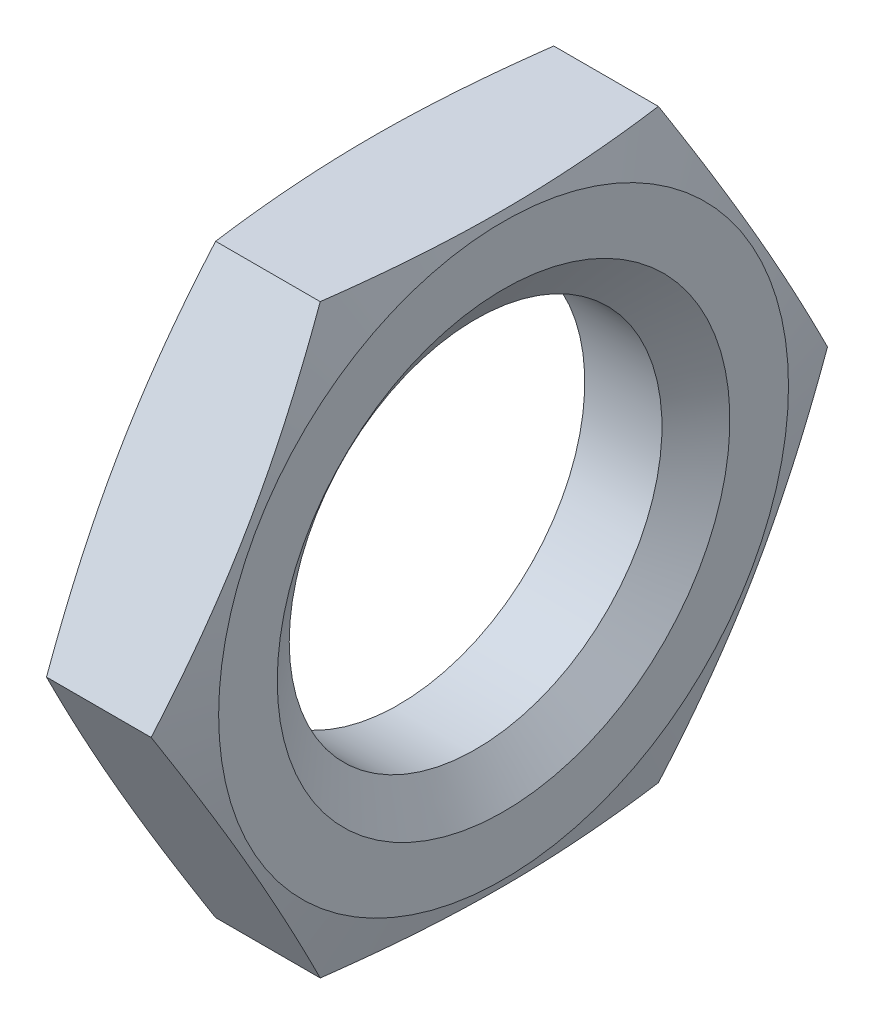
ISO-10303-21;
HEADER;
FILE_DESCRIPTION(('STEP AP214'),'2;1');
FILE_NAME('part.step','',(''),(''),'','','');
FILE_SCHEMA(('AUTOMOTIVE_DESIGN { 1 0 10303 214 1 1 1 1 }'));
ENDSEC;
DATA;
#1=APPLICATION_CONTEXT('core data for automotive mechanical design processes');
#2=APPLICATION_PROTOCOL_DEFINITION('international standard','automotive_design',2000,#1);
#3=PRODUCT_CONTEXT('',#1,'mechanical');
#4=PRODUCT('Part','Part','',(#3));
#5=PRODUCT_RELATED_PRODUCT_CATEGORY('part','',(#4));
#6=PRODUCT_DEFINITION_FORMATION('','',#4);
#7=PRODUCT_DEFINITION_CONTEXT('part definition',#1,'design');
#8=PRODUCT_DEFINITION('design','',#6,#7);
#9=PRODUCT_DEFINITION_SHAPE('','',#8);
#10=(LENGTH_UNIT() NAMED_UNIT(*) SI_UNIT(.MILLI.,.METRE.));
#11=(NAMED_UNIT(*) PLANE_ANGLE_UNIT() SI_UNIT($,.RADIAN.));
#12=(NAMED_UNIT(*) SI_UNIT($,.STERADIAN.) SOLID_ANGLE_UNIT());
#13=UNCERTAINTY_MEASURE_WITH_UNIT(LENGTH_MEASURE(1.E-05),#10,'distance_accuracy_value','');
#14=(GEOMETRIC_REPRESENTATION_CONTEXT(3) GLOBAL_UNCERTAINTY_ASSIGNED_CONTEXT((#13)) GLOBAL_UNIT_ASSIGNED_CONTEXT((#10,
#11,#12)) REPRESENTATION_CONTEXT('',''));
#15=CARTESIAN_POINT('',(0.,0.,0.));
#16=DIRECTION('',(0.,0.,1.));
#17=DIRECTION('',(1.,0.,0.));
#18=AXIS2_PLACEMENT_3D('',#15,#16,#17);
#19=CARTESIAN_POINT('',(2.5,0.,-6.35085296108588));
#20=DIRECTION('',(1.,0.,0.));
#21=DIRECTION('',(0.,0.,-1.));
#22=AXIS2_PLACEMENT_3D('',#19,#20,#21);
#23=PLANE('',#22);
#24=CARTESIAN_POINT('',(2.5,0.,0.));
#25=DIRECTION('',(-1.,0.,0.));
#26=DIRECTION('',(0.,0.,1.));
#27=AXIS2_PLACEMENT_3D('',#24,#25,#26);
#28=CIRCLE('',#27,4.25);
#29=CARTESIAN_POINT('',(2.5,0.,4.25));
#30=VERTEX_POINT('',#29);
#31=EDGE_CURVE('E220',#30,#30,#28,.T.);
#32=ORIENTED_EDGE('',*,*,#31,.T.);
#33=EDGE_LOOP('',(#32));
#34=FACE_BOUND('',#33,.T.);
#35=CARTESIAN_POINT('',(2.5,0.,0.));
#36=DIRECTION('',(-1.,0.,0.));
#37=DIRECTION('',(0.,0.,1.));
#38=AXIS2_PLACEMENT_3D('',#35,#36,#37);
#39=CIRCLE('',#38,5.35085296108588);
#40=CARTESIAN_POINT('',(2.5,0.,5.35085296108588));
#41=VERTEX_POINT('',#40);
#42=EDGE_CURVE('E205',#41,#41,#39,.T.);
#43=ORIENTED_EDGE('',*,*,#42,.F.);
#44=EDGE_LOOP('',(#43));
#45=FACE_BOUND('',#44,.T.);
#46=ADVANCED_FACE('F31',(#34,#45),#23,.T.);
#47=CARTESIAN_POINT('',(2.23205080756889,0.,0.));
#48=DIRECTION('',(-1.,0.,0.));
#49=DIRECTION('',(0.,0.,1.));
#50=AXIS2_PLACEMENT_3D('',#47,#48,#49);
#51=CONICAL_SURFACE('',#50,6.35085296108588,1.30899693899576);
#52=ORIENTED_EDGE('',*,*,#42,.T.);
#53=EDGE_LOOP('',(#52));
#54=FACE_BOUND('',#53,.T.);
#55=CARTESIAN_POINT('',(2.23201986661741,-5.5002,-3.1753110104891));
#56=CARTESIAN_POINT('',(2.26737151162748,-5.27178224927437,-3.30718806035824));
#57=CARTESIAN_POINT('',(2.29946500235455,-5.04295034408125,-3.43930422242066));
#58=CARTESIAN_POINT('',(2.35585029341694,-4.58447837603354,-3.7040031365889));
#59=CARTESIAN_POINT('',(2.38013892468663,-4.35483802308176,-3.83658605618241));
#60=CARTESIAN_POINT('',(2.41949651038344,-3.89614150611578,-4.10141461372906));
#61=CARTESIAN_POINT('',(2.43461240156884,-3.6670884439752,-4.23365846081464));
#62=CARTESIAN_POINT('',(2.45488126821387,-3.20869021114574,-4.49831480393477));
#63=CARTESIAN_POINT('',(2.46003617136947,-2.97934510557287,-4.63072726237459));
#64=CARTESIAN_POINT('',(2.46003617136947,-2.52065489442713,-4.89555217925423));
#65=CARTESIAN_POINT('',(2.45488126821387,-2.29130978885426,-5.02796463769405));
#66=CARTESIAN_POINT('',(2.43461240156884,-1.8329115560248,-5.29262098081419));
#67=CARTESIAN_POINT('',(2.41949651038344,-1.60385849388422,-5.42486482789976));
#68=CARTESIAN_POINT('',(2.38013892468663,-1.14516197691824,-5.68969338544641));
#69=CARTESIAN_POINT('',(2.35585029341694,-0.915521623966466,-5.82227630503992));
#70=CARTESIAN_POINT('',(2.29946500235455,-0.457049655918756,-6.08697521920816));
#71=CARTESIAN_POINT('',(2.26737151162748,-0.228217750725632,-6.21909138127059));
#72=CARTESIAN_POINT('',(2.23201986661741,0.000200000000001465,-6.35096843113972));
#73=B_SPLINE_CURVE_WITH_KNOTS('',3,(#55,#56,#57,#58,#59,#60,#61,#62,#63,#64,#65,#66,#67,#68,#69,
#70,#71,#72),.UNSPECIFIED.,.F.,.F.,(4,2,2,2,2,2,2,2,4),(0.,0.798379902464036,1.59708356868763,
2.3916650401428,3.1860927251517,3.9805204101606,4.77510188161577,5.57380554783936,
6.3721854503034),.UNSPECIFIED.);
#74=CARTESIAN_POINT('',(2.23205080756889,-5.50000000000001,-3.17542648054293));
#75=VERTEX_POINT('',#74);
#76=CARTESIAN_POINT('',(2.23205080756889,0.,-6.35085296108588));
#77=VERTEX_POINT('',#76);
#78=EDGE_CURVE('E194',#75,#77,#73,.T.);
#79=ORIENTED_EDGE('',*,*,#78,.T.);
#80=CARTESIAN_POINT('',(2.23201986661741,-0.000199999999998251,-6.35096843113972));
#81=CARTESIAN_POINT('',(2.26737151162748,0.228217750725634,-6.21909138127059));
#82=CARTESIAN_POINT('',(2.29946500235455,0.457049655918758,-6.08697521920816));
#83=CARTESIAN_POINT('',(2.35585029341694,0.915521623966467,-5.82227630503992));
#84=CARTESIAN_POINT('',(2.38013892468663,1.14516197691825,-5.68969338544641));
#85=CARTESIAN_POINT('',(2.41949651038344,1.60385849388422,-5.42486482789976));
#86=CARTESIAN_POINT('',(2.43461240156884,1.8329115560248,-5.29262098081419));
#87=CARTESIAN_POINT('',(2.45488126821387,2.29130978885426,-5.02796463769405));
#88=CARTESIAN_POINT('',(2.46003617136947,2.52065489442713,-4.89555217925423));
#89=CARTESIAN_POINT('',(2.46003617136947,2.97934510557287,-4.63072726237459));
#90=CARTESIAN_POINT('',(2.45488126821387,3.20869021114574,-4.49831480393477));
#91=CARTESIAN_POINT('',(2.43461240156884,3.6670884439752,-4.23365846081463));
#92=CARTESIAN_POINT('',(2.41949651038344,3.89614150611578,-4.10141461372906));
#93=CARTESIAN_POINT('',(2.38013892468663,4.35483802308176,-3.83658605618241));
#94=CARTESIAN_POINT('',(2.35585029341694,4.58447837603353,-3.7040031365889));
#95=CARTESIAN_POINT('',(2.29946500235455,5.04295034408124,-3.43930422242066));
#96=CARTESIAN_POINT('',(2.26737151162748,5.27178224927437,-3.30718806035823));
#97=CARTESIAN_POINT('',(2.23201986661741,5.5002,-3.1753110104891));
#98=B_SPLINE_CURVE_WITH_KNOTS('',3,(#80,#81,#82,#83,#84,#85,#86,#87,#88,#89,#90,#91,#92,#93,#94,
#95,#96,#97),.UNSPECIFIED.,.F.,.F.,(4,2,2,2,2,2,2,2,4),(0.,0.798379902464034,1.59708356868763,
2.3916650401428,3.18609272515169,3.98052041016059,4.77510188161576,5.57380554783935,
6.37218545030339),.UNSPECIFIED.);
#99=CARTESIAN_POINT('',(2.23205080756889,5.5,-3.17542648054294));
#100=VERTEX_POINT('',#99);
#101=EDGE_CURVE('E121',#77,#100,#98,.T.);
#102=ORIENTED_EDGE('',*,*,#101,.T.);
#103=CARTESIAN_POINT('',(1.24511812311218,5.5,-8.39248967357683));
#104=CARTESIAN_POINT('',(1.30100378769512,5.5,-8.14305660960824));
#105=CARTESIAN_POINT('',(1.35620467718188,5.5,-7.89346731934267));
#106=CARTESIAN_POINT('',(1.46486729065078,5.5,-7.39389957758472));
#107=CARTESIAN_POINT('',(1.51832893928115,5.5,-7.14392110972175));
#108=CARTESIAN_POINT('',(1.6231901902578,5.5,-6.64327335227768));
#109=CARTESIAN_POINT('',(1.67458770894926,5.5,-6.39260362471131));
#110=CARTESIAN_POINT('',(1.77476469288153,5.5,-5.89074186134932));
#111=CARTESIAN_POINT('',(1.82354418030007,5.5,-5.63954982999694));
#112=CARTESIAN_POINT('',(1.91748512016332,5.5,-5.1385602583105));
#113=CARTESIAN_POINT('',(1.9626723208235,5.5,-4.88876756993107));
#114=CARTESIAN_POINT('',(2.04909321378185,5.5,-4.3885004113485));
#115=CARTESIAN_POINT('',(2.09032699327634,5.5,-4.13802595630772));
#116=CARTESIAN_POINT('',(2.16791101436559,5.5,-3.63634751621525));
#117=CARTESIAN_POINT('',(2.20426186971051,5.5,-3.38514362691108));
#118=CARTESIAN_POINT('',(2.27100744642318,5.5,-2.88193672723408));
#119=CARTESIAN_POINT('',(2.30140216253249,5.5,-2.62993371615594));
#120=CARTESIAN_POINT('',(2.35537317089146,5.5,-2.12228838222805));
#121=CARTESIAN_POINT('',(2.37886798178985,5.5,-1.86663726596456));
#122=CARTESIAN_POINT('',(2.41741731524635,5.5,-1.35469399102192));
#123=CARTESIAN_POINT('',(2.43247203136967,5.5,-1.09840184717953));
#124=CARTESIAN_POINT('',(2.45326304243536,5.5,-0.585548156581367));
#125=CARTESIAN_POINT('',(2.45900354631518,5.5,-0.328986783961889));
#126=CARTESIAN_POINT('',(2.4608133821082,5.5,0.184170586346425));
#127=CARTESIAN_POINT('',(2.45688272094889,5.5,0.440766584010328));
#128=CARTESIAN_POINT('',(2.43957125656513,5.5,0.954568261768439));
#129=CARTESIAN_POINT('',(2.42615610392627,5.5,1.21177276091473));
#130=CARTESIAN_POINT('',(2.3906405747507,5.5,1.72557585094103));
#131=CARTESIAN_POINT('',(2.36854000648964,5.5,1.98217442831996));
#132=CARTESIAN_POINT('',(2.31676822959434,5.5,2.49476384827405));
#133=CARTESIAN_POINT('',(2.28709209494727,5.5,2.75075418560622));
#134=CARTESIAN_POINT('',(2.22140121462773,5.5,3.26191119814674));
#135=CARTESIAN_POINT('',(2.18538644930256,5.5,3.51707787079886));
#136=CARTESIAN_POINT('',(2.11073111793396,5.5,4.00971385762619));
#137=CARTESIAN_POINT('',(2.07242330606494,5.5,4.24723410116291));
#138=CARTESIAN_POINT('',(1.99209109357318,5.5,4.72164784868495));
#139=CARTESIAN_POINT('',(1.95006659185651,5.5,4.95854133544189));
#140=CARTESIAN_POINT('',(1.81946866225354,5.5,5.66842768485918));
#141=CARTESIAN_POINT('',(1.7263769592733,5.5,6.14058746083545));
#142=CARTESIAN_POINT('',(1.53215871630118,5.5,7.08334203179498));
#143=CARTESIAN_POINT('',(1.43103024040794,5.5,7.553936421092));
#144=CARTESIAN_POINT('',(1.22328823192818,5.5,8.49387894353116));
#145=CARTESIAN_POINT('',(1.11667501920882,5.5,8.96322714767519));
#146=CARTESIAN_POINT('',(0.900667451567304,5.5,9.89640720615578));
#147=CARTESIAN_POINT('',(0.791310854006441,5.5,10.3602478445023));
#148=CARTESIAN_POINT('',(0.569860038826538,5.5,11.2872825926215));
#149=CARTESIAN_POINT('',(0.457765771476534,5.5,11.7504766904875));
#150=CARTESIAN_POINT('',(0.23169438145977,5.5,12.6758001544558));
#151=CARTESIAN_POINT('',(0.117719745102526,5.5,13.1379301293837));
#152=CARTESIAN_POINT('',(-0.111785576919252,5.5,14.0617876458123));
#153=CARTESIAN_POINT('',(-0.22731621121804,5.5,14.5235152000644));
#154=CARTESIAN_POINT('',(-0.343398122700473,5.5,14.9851024984395));
#155=B_SPLINE_CURVE_WITH_KNOTS('',3,(#103,#104,#105,#106,#107,#108,#109,#110,#111,#112,#113,
#114,#115,#116,#117,#118,#119,#120,#121,#122,#123,#124,#125,#126,#127,#128,#129,#130,#131,#132,
#133,#134,#135,#136,#137,#138,#139,#140,#141,#142,#143,#144,#145,#146,#147,#148,#149,#150,#151,
#152,#153,#154),.UNSPECIFIED.,.F.,.F.,(4,2,2,2,2,2,2,2,2,2,2,2,2,2,2,2,2,2,2,2,2,2,2,2,2,4),(0.,
0.766854190935476,1.53374156133574,2.30138455265248,3.06902104012373,3.83053649357037,
4.59203514722893,5.35343799597632,6.11484151693668,6.88490488652958,7.65495059476033,
8.42464823514552,9.19434532419317,9.9668443538516,10.7393604368316,11.5123801337527,
12.2854022274362,13.0071360083816,13.7288894265218,15.1725145960398,16.6164885668159,
18.0603784209896,19.4900402724415,20.9197281136683,22.3476569023426,23.7755386679991),.UNSPECIFIED.);
#156=CARTESIAN_POINT('',(2.23205080756889,5.5,3.17542648054295));
#157=VERTEX_POINT('',#156);
#158=EDGE_CURVE('E116',#100,#157,#155,.T.);
#159=ORIENTED_EDGE('',*,*,#158,.T.);
#160=CARTESIAN_POINT('',(2.23201986661741,5.5002,3.17531101048911));
#161=CARTESIAN_POINT('',(2.26737151162748,5.27178224927437,3.30718806035824));
#162=CARTESIAN_POINT('',(2.29946500235455,5.04295034408125,3.43930422242066));
#163=CARTESIAN_POINT('',(2.35585029341694,4.58447837603354,3.70400313658891));
#164=CARTESIAN_POINT('',(2.38013892468663,4.35483802308176,3.83658605618242));
#165=CARTESIAN_POINT('',(2.41949651038344,3.89614150611578,4.10141461372906));
#166=CARTESIAN_POINT('',(2.43461240156884,3.6670884439752,4.23365846081464));
#167=CARTESIAN_POINT('',(2.45488126821387,3.20869021114574,4.49831480393477));
#168=CARTESIAN_POINT('',(2.46003617136947,2.97934510557287,4.63072726237459));
#169=CARTESIAN_POINT('',(2.46003617136947,2.52065489442713,4.89555217925423));
#170=CARTESIAN_POINT('',(2.45488126821387,2.29130978885426,5.02796463769405));
#171=CARTESIAN_POINT('',(2.43461240156884,1.8329115560248,5.29262098081419));
#172=CARTESIAN_POINT('',(2.41949651038344,1.60385849388422,5.42486482789976));
#173=CARTESIAN_POINT('',(2.38013892468663,1.14516197691825,5.68969338544641));
#174=CARTESIAN_POINT('',(2.35585029341694,0.915521623966467,5.82227630503992));
#175=CARTESIAN_POINT('',(2.29946500235455,0.457049655918757,6.08697521920816));
#176=CARTESIAN_POINT('',(2.26737151162748,0.228217750725633,6.21909138127059));
#177=CARTESIAN_POINT('',(2.23201986661741,-0.000199999999999302,6.35096843113972));
#178=B_SPLINE_CURVE_WITH_KNOTS('',3,(#160,#161,#162,#163,#164,#165,#166,#167,#168,#169,#170,
#171,#172,#173,#174,#175,#176,#177),.UNSPECIFIED.,.F.,.F.,(4,2,2,2,2,2,2,2,4),(0.,
0.798379902464035,1.59708356868763,2.3916650401428,3.1860927251517,3.9805204101606,
4.77510188161576,5.57380554783936,6.37218545030339),.UNSPECIFIED.);
#179=CARTESIAN_POINT('',(2.23205080756889,0.,6.35085296108588));
#180=VERTEX_POINT('',#179);
#181=EDGE_CURVE('E177',#157,#180,#178,.T.);
#182=ORIENTED_EDGE('',*,*,#181,.T.);
#183=CARTESIAN_POINT('',(2.23201986661741,0.000199999999998312,6.35096843113972));
#184=CARTESIAN_POINT('',(2.26737151162748,-0.228217750725634,6.21909138127059));
#185=CARTESIAN_POINT('',(2.29946500235455,-0.457049655918758,6.08697521920817));
#186=CARTESIAN_POINT('',(2.35585029341694,-0.915521623966468,5.82227630503992));
#187=CARTESIAN_POINT('',(2.38013892468663,-1.14516197691825,5.68969338544641));
#188=CARTESIAN_POINT('',(2.41949651038344,-1.60385849388422,5.42486482789976));
#189=CARTESIAN_POINT('',(2.43461240156884,-1.8329115560248,5.29262098081419));
#190=CARTESIAN_POINT('',(2.45488126821387,-2.29130978885426,5.02796463769405));
#191=CARTESIAN_POINT('',(2.46003617136947,-2.52065489442713,4.89555217925423));
#192=CARTESIAN_POINT('',(2.46003617136947,-2.97934510557287,4.63072726237459));
#193=CARTESIAN_POINT('',(2.45488126821387,-3.20869021114575,4.49831480393477));
#194=CARTESIAN_POINT('',(2.43461240156884,-3.6670884439752,4.23365846081464));
#195=CARTESIAN_POINT('',(2.41949651038344,-3.89614150611579,4.10141461372907));
#196=CARTESIAN_POINT('',(2.38013892468663,-4.35483802308176,3.83658605618242));
#197=CARTESIAN_POINT('',(2.35585029341694,-4.58447837603354,3.70400313658891));
#198=CARTESIAN_POINT('',(2.29946500235455,-5.04295034408125,3.43930422242066));
#199=CARTESIAN_POINT('',(2.26737151162748,-5.27178224927437,3.30718806035824));
#200=CARTESIAN_POINT('',(2.23201986661741,-5.5002,3.17531101048911));
#201=B_SPLINE_CURVE_WITH_KNOTS('',3,(#183,#184,#185,#186,#187,#188,#189,#190,#191,#192,#193,
#194,#195,#196,#197,#198,#199,#200),.UNSPECIFIED.,.F.,.F.,(4,2,2,2,2,2,2,2,4),(0.,
0.798379902464034,1.59708356868763,2.3916650401428,3.1860927251517,3.9805204101606,
4.77510188161576,5.57380554783936,6.37218545030339),.UNSPECIFIED.);
#202=CARTESIAN_POINT('',(2.23205080756889,-5.5,3.17542648054294));
#203=VERTEX_POINT('',#202);
#204=EDGE_CURVE('E47',#180,#203,#201,.T.);
#205=ORIENTED_EDGE('',*,*,#204,.T.);
#206=CARTESIAN_POINT('',(1.24511812311217,-5.50000000000001,-8.39248967357684));
#207=CARTESIAN_POINT('',(1.30100378769512,-5.50000000000001,-8.14305660960825));
#208=CARTESIAN_POINT('',(1.35620467718188,-5.50000000000001,-7.89346731934268));
#209=CARTESIAN_POINT('',(1.46486729065078,-5.50000000000001,-7.39389957758473));
#210=CARTESIAN_POINT('',(1.51832893928115,-5.50000000000001,-7.14392110972175));
#211=CARTESIAN_POINT('',(1.6231901902578,-5.50000000000001,-6.64327335227768));
#212=CARTESIAN_POINT('',(1.67458770894926,-5.50000000000001,-6.39260362471131));
#213=CARTESIAN_POINT('',(1.77476469288153,-5.50000000000001,-5.89074186134932));
#214=CARTESIAN_POINT('',(1.82354418030007,-5.50000000000001,-5.63954982999694));
#215=CARTESIAN_POINT('',(1.91748512016331,-5.50000000000001,-5.1385602583105));
#216=CARTESIAN_POINT('',(1.9626723208235,-5.50000000000001,-4.88876756993108));
#217=CARTESIAN_POINT('',(2.04909321378185,-5.50000000000001,-4.38850041134851));
#218=CARTESIAN_POINT('',(2.09032699327634,-5.50000000000001,-4.13802595630772));
#219=CARTESIAN_POINT('',(2.16791101436559,-5.50000000000001,-3.63634751621525));
#220=CARTESIAN_POINT('',(2.2042618697105,-5.50000000000001,-3.38514362691108));
#221=CARTESIAN_POINT('',(2.27100744642318,-5.50000000000001,-2.88193672723409));
#222=CARTESIAN_POINT('',(2.30140216253248,-5.50000000000001,-2.62993371615594));
#223=CARTESIAN_POINT('',(2.35537317089146,-5.50000000000001,-2.12228838222806));
#224=CARTESIAN_POINT('',(2.37886798178985,-5.50000000000001,-1.86663726596456));
#225=CARTESIAN_POINT('',(2.41741731524635,-5.50000000000001,-1.35469399102192));
#226=CARTESIAN_POINT('',(2.43247203136967,-5.50000000000001,-1.09840184717954));
#227=CARTESIAN_POINT('',(2.45326304243536,-5.50000000000001,-0.585548156581368));
#228=CARTESIAN_POINT('',(2.45900354631518,-5.50000000000001,-0.32898678396189));
#229=CARTESIAN_POINT('',(2.4608133821082,-5.50000000000001,0.184170586346425));
#230=CARTESIAN_POINT('',(2.45688272094889,-5.5,0.440766584010327));
#231=CARTESIAN_POINT('',(2.43957125656513,-5.5,0.954568261768437));
#232=CARTESIAN_POINT('',(2.42615610392627,-5.5,1.21177276091473));
#233=CARTESIAN_POINT('',(2.3906405747507,-5.5,1.72557585094103));
#234=CARTESIAN_POINT('',(2.36854000648964,-5.5,1.98217442831995));
#235=CARTESIAN_POINT('',(2.31676822959434,-5.5,2.49476384827405));
#236=CARTESIAN_POINT('',(2.28709209494727,-5.5,2.75075418560622));
#237=CARTESIAN_POINT('',(2.22140121462773,-5.5,3.26191119814674));
#238=CARTESIAN_POINT('',(2.18538644930256,-5.5,3.51707787079885));
#239=CARTESIAN_POINT('',(2.11073111793396,-5.5,4.00971385762619));
#240=CARTESIAN_POINT('',(2.07242330606494,-5.5,4.24723410116291));
#241=CARTESIAN_POINT('',(1.99209109357318,-5.5,4.72164784868495));
#242=CARTESIAN_POINT('',(1.9500665918565,-5.5,4.95854133544189));
#243=CARTESIAN_POINT('',(1.81946866225353,-5.5,5.66842768485918));
#244=CARTESIAN_POINT('',(1.7263769592733,-5.5,6.14058746083545));
#245=CARTESIAN_POINT('',(1.53215871630118,-5.5,7.08334203179498));
#246=CARTESIAN_POINT('',(1.43103024040794,-5.5,7.553936421092));
#247=CARTESIAN_POINT('',(1.22328823192818,-5.5,8.49387894353116));
#248=CARTESIAN_POINT('',(1.11667501920882,-5.5,8.96322714767519));
#249=CARTESIAN_POINT('',(0.900667451567304,-5.5,9.89640720615578));
#250=CARTESIAN_POINT('',(0.791310854006441,-5.5,10.3602478445023));
#251=CARTESIAN_POINT('',(0.569860038826538,-5.5,11.2872825926215));
#252=CARTESIAN_POINT('',(0.457765771476533,-5.5,11.7504766904875));
#253=CARTESIAN_POINT('',(0.231694381459769,-5.5,12.6758001544558));
#254=CARTESIAN_POINT('',(0.117719745102525,-5.5,13.1379301293837));
#255=CARTESIAN_POINT('',(-0.111785576919252,-5.5,14.0617876458123));
#256=CARTESIAN_POINT('',(-0.227316211218041,-5.5,14.5235152000644));
#257=CARTESIAN_POINT('',(-0.343398122700476,-5.5,14.9851024984395));
#258=B_SPLINE_CURVE_WITH_KNOTS('',3,(#206,#207,#208,#209,#210,#211,#212,#213,#214,#215,#216,
#217,#218,#219,#220,#221,#222,#223,#224,#225,#226,#227,#228,#229,#230,#231,#232,#233,#234,#235,
#236,#237,#238,#239,#240,#241,#242,#243,#244,#245,#246,#247,#248,#249,#250,#251,#252,#253,#254,
#255,#256,#257),.UNSPECIFIED.,.F.,.F.,(4,2,2,2,2,2,2,2,2,2,2,2,2,2,2,2,2,2,2,2,2,2,2,2,2,4),(0.,
0.766854190935477,1.53374156133574,2.30138455265248,3.06902104012374,3.83053649357037,
4.59203514722893,5.35343799597633,6.11484151693668,6.88490488652958,7.65495059476033,
8.42464823514553,9.19434532419318,9.9668443538516,10.7393604368316,11.5123801337528,
12.2854022274362,13.0071360083816,13.7288894265218,15.1725145960398,16.6164885668159,
18.0603784209897,19.4900402724415,20.9197281136683,22.3476569023427,23.7755386679991),.UNSPECIFIED.);
#259=EDGE_CURVE('E125',#203,#75,#258,.F.);
#260=ORIENTED_EDGE('',*,*,#259,.T.);
#261=EDGE_LOOP('',(#79,#102,#159,#182,#205,#260));
#262=FACE_BOUND('',#261,.T.);
#263=ADVANCED_FACE('F148',(#54,#262),#51,.T.);
#264=CARTESIAN_POINT('',(2.5,-5.50000000000001,-3.17542648054294));
#265=DIRECTION('',(0.,0.5,0.866025403784439));
#266=DIRECTION('',(0.,-0.866025403784439,0.5));
#267=AXIS2_PLACEMENT_3D('',#264,#265,#266);
#268=PLANE('',#267);
#269=CARTESIAN_POINT('',(0.267980133382597,0.000200000000001817,-6.35096843113972));
#270=CARTESIAN_POINT('',(0.232628488372524,-0.22821775072563,-6.21909138127059));
#271=CARTESIAN_POINT('',(0.200534997645457,-0.457049655918755,-6.08697521920816));
#272=CARTESIAN_POINT('',(0.144149706583062,-0.915521623966466,-5.82227630503992));
#273=CARTESIAN_POINT('',(0.119861075313372,-1.14516197691825,-5.68969338544641));
#274=CARTESIAN_POINT('',(0.0805034896165583,-1.60385849388422,-5.42486482789976));
#275=CARTESIAN_POINT('',(0.0653875984311642,-1.8329115560248,-5.29262098081419));
#276=CARTESIAN_POINT('',(0.0451187317861272,-2.29130978885426,-5.02796463769405));
#277=CARTESIAN_POINT('',(0.0399638286305299,-2.52065489442713,-4.89555217925423));
#278=CARTESIAN_POINT('',(0.03996382863053,-2.97934510557287,-4.63072726237459));
#279=CARTESIAN_POINT('',(0.0451187317861274,-3.20869021114575,-4.49831480393477));
#280=CARTESIAN_POINT('',(0.0653875984311647,-3.6670884439752,-4.23365846081463));
#281=CARTESIAN_POINT('',(0.0805034896165589,-3.89614150611579,-4.10141461372906));
#282=CARTESIAN_POINT('',(0.119861075313372,-4.35483802308176,-3.83658605618241));
#283=CARTESIAN_POINT('',(0.144149706583063,-4.58447837603354,-3.7040031365889));
#284=CARTESIAN_POINT('',(0.200534997645458,-5.04295034408125,-3.43930422242066));
#285=CARTESIAN_POINT('',(0.232628488372526,-5.27178224927437,-3.30718806035824));
#286=CARTESIAN_POINT('',(0.267980133382599,-5.50020000000001,-3.1753110104891));
#287=B_SPLINE_CURVE_WITH_KNOTS('',3,(#269,#270,#271,#272,#273,#274,#275,#276,#277,#278,#279,
#280,#281,#282,#283,#284,#285,#286),.UNSPECIFIED.,.F.,.F.,(4,2,2,2,2,2,2,2,4),(0.,
0.798379902464036,1.59708356868763,2.3916650401428,3.1860927251517,3.9805204101606,
4.77510188161577,5.57380554783936,6.3721854503034),.UNSPECIFIED.);
#288=CARTESIAN_POINT('',(0.267949192431116,0.,-6.35085296108588));
#289=VERTEX_POINT('',#288);
#290=CARTESIAN_POINT('',(0.267949192431116,-5.50000000000001,-3.17542648054294));
#291=VERTEX_POINT('',#290);
#292=EDGE_CURVE('E55',#289,#291,#287,.T.);
#293=ORIENTED_EDGE('',*,*,#292,.F.);
#294=DIRECTION('',(-1.,0.,0.));
#295=VECTOR('',#294,1.);
#296=CARTESIAN_POINT('',(2.5,0.,-6.35085296108588));
#297=LINE('',#296,#295);
#298=EDGE_CURVE('E11',#77,#289,#297,.T.);
#299=ORIENTED_EDGE('',*,*,#298,.F.);
#300=ORIENTED_EDGE('',*,*,#78,.F.);
#301=DIRECTION('',(-1.,0.,0.));
#302=VECTOR('',#301,1.);
#303=CARTESIAN_POINT('',(2.5,-5.50000000000001,-3.17542648054294));
#304=LINE('',#303,#302);
#305=EDGE_CURVE('E108',#75,#291,#304,.T.);
#306=ORIENTED_EDGE('',*,*,#305,.T.);
#307=EDGE_LOOP('',(#293,#299,#300,#306));
#308=FACE_BOUND('',#307,.T.);
#309=ADVANCED_FACE('F33',(#308),#268,.F.);
#310=CARTESIAN_POINT('',(2.5,0.,-6.35085296108588));
#311=DIRECTION('',(0.,-0.5,0.866025403784438));
#312=DIRECTION('',(0.,-0.866025403784438,-0.5));
#313=AXIS2_PLACEMENT_3D('',#310,#311,#312);
#314=PLANE('',#313);
#315=CARTESIAN_POINT('',(0.267980133382598,5.5002,-3.1753110104891));
#316=CARTESIAN_POINT('',(0.232628488372525,5.27178224927437,-3.30718806035823));
#317=CARTESIAN_POINT('',(0.200534997645457,5.04295034408125,-3.43930422242066));
#318=CARTESIAN_POINT('',(0.144149706583062,4.58447837603354,-3.7040031365889));
#319=CARTESIAN_POINT('',(0.119861075313372,4.35483802308176,-3.83658605618241));
#320=CARTESIAN_POINT('',(0.0805034896165582,3.89614150611578,-4.10141461372906));
#321=CARTESIAN_POINT('',(0.065387598431164,3.6670884439752,-4.23365846081463));
#322=CARTESIAN_POINT('',(0.0451187317861269,3.20869021114574,-4.49831480393477));
#323=CARTESIAN_POINT('',(0.0399638286305296,2.97934510557287,-4.63072726237459));
#324=CARTESIAN_POINT('',(0.0399638286305296,2.52065489442713,-4.89555217925423));
#325=CARTESIAN_POINT('',(0.0451187317861269,2.29130978885426,-5.02796463769405));
#326=CARTESIAN_POINT('',(0.065387598431164,1.8329115560248,-5.29262098081419));
#327=CARTESIAN_POINT('',(0.080503489616558,1.60385849388422,-5.42486482789976));
#328=CARTESIAN_POINT('',(0.119861075313372,1.14516197691825,-5.68969338544641));
#329=CARTESIAN_POINT('',(0.144149706583062,0.915521623966468,-5.82227630503992));
#330=CARTESIAN_POINT('',(0.200534997645457,0.457049655918758,-6.08697521920816));
#331=CARTESIAN_POINT('',(0.232628488372524,0.228217750725634,-6.21909138127059));
#332=CARTESIAN_POINT('',(0.267980133382597,-0.000199999999998516,-6.35096843113972));
#333=B_SPLINE_CURVE_WITH_KNOTS('',3,(#315,#316,#317,#318,#319,#320,#321,#322,#323,#324,#325,
#326,#327,#328,#329,#330,#331,#332),.UNSPECIFIED.,.F.,.F.,(4,2,2,2,2,2,2,2,4),(0.,
0.798379902464035,1.59708356868763,2.3916650401428,3.1860927251517,3.9805204101606,
4.77510188161577,5.57380554783936,6.37218545030339),.UNSPECIFIED.);
#334=CARTESIAN_POINT('',(0.267949192431116,5.5,-3.17542648054294));
#335=VERTEX_POINT('',#334);
#336=EDGE_CURVE('E123',#335,#289,#333,.T.);
#337=ORIENTED_EDGE('',*,*,#336,.F.);
#338=DIRECTION('',(-1.,0.,0.));
#339=VECTOR('',#338,1.);
#340=CARTESIAN_POINT('',(2.5,5.5,-3.17542648054294));
#341=LINE('',#340,#339);
#342=EDGE_CURVE('E40',#100,#335,#341,.T.);
#343=ORIENTED_EDGE('',*,*,#342,.F.);
#344=ORIENTED_EDGE('',*,*,#101,.F.);
#345=ORIENTED_EDGE('',*,*,#298,.T.);
#346=EDGE_LOOP('',(#337,#343,#344,#345));
#347=FACE_BOUND('',#346,.T.);
#348=ADVANCED_FACE('F120',(#347),#314,.F.);
#349=CARTESIAN_POINT('',(2.5,5.5,-3.17542648054294));
#350=DIRECTION('',(0.,-1.,0.));
#351=DIRECTION('',(0.,0.,-1.));
#352=AXIS2_PLACEMENT_3D('',#349,#350,#351);
#353=PLANE('',#352);
#354=CARTESIAN_POINT('',(1.25488187688785,5.5,-8.39248967357684));
#355=CARTESIAN_POINT('',(1.1989962123049,5.5,-8.14305660960825));
#356=CARTESIAN_POINT('',(1.14379532281814,5.5,-7.89346731934268));
#357=CARTESIAN_POINT('',(1.03513270934924,5.5,-7.39389957758472));
#358=CARTESIAN_POINT('',(0.981671060718871,5.5,-7.14392110972175));
#359=CARTESIAN_POINT('',(0.876809809742217,5.5,-6.64327335227768));
#360=CARTESIAN_POINT('',(0.825412291050753,5.5,-6.39260362471131));
#361=CARTESIAN_POINT('',(0.725235307118481,5.5,-5.89074186134932));
#362=CARTESIAN_POINT('',(0.676455819699938,5.5,-5.63954982999694));
#363=CARTESIAN_POINT('',(0.582514879836695,5.5,-5.1385602583105));
#364=CARTESIAN_POINT('',(0.537327679176506,5.5,-4.88876756993107));
#365=CARTESIAN_POINT('',(0.450906786218159,5.5,-4.38850041134851));
#366=CARTESIAN_POINT('',(0.409673006723668,5.5,-4.13802595630772));
#367=CARTESIAN_POINT('',(0.332088985634412,5.5,-3.63634751621525));
#368=CARTESIAN_POINT('',(0.2957381302895,5.5,-3.38514362691108));
#369=CARTESIAN_POINT('',(0.22899255357682,5.5,-2.88193672723409));
#370=CARTESIAN_POINT('',(0.198597837467519,5.5,-2.62993371615594));
#371=CARTESIAN_POINT('',(0.144626829108545,5.5,-2.12228838222806));
#372=CARTESIAN_POINT('',(0.121132018210154,5.5,-1.86663726596456));
#373=CARTESIAN_POINT('',(0.0825826847536466,5.5,-1.35469399102192));
#374=CARTESIAN_POINT('',(0.067527968630327,5.5,-1.09840184717953));
#375=CARTESIAN_POINT('',(0.0467369575646426,5.5,-0.585548156581366));
#376=CARTESIAN_POINT('',(0.0409964536848178,5.5,-0.328986783961888));
#377=CARTESIAN_POINT('',(0.0391866178918017,5.5,0.184170586346428));
#378=CARTESIAN_POINT('',(0.0431172790511136,5.5,0.440766584010331));
#379=CARTESIAN_POINT('',(0.0604287434348688,5.5,0.954568261768443));
#380=CARTESIAN_POINT('',(0.0738438960737274,5.5,1.21177276091474));
#381=CARTESIAN_POINT('',(0.109359425249306,5.5,1.72557585094104));
#382=CARTESIAN_POINT('',(0.131459993510365,5.5,1.98217442831996));
#383=CARTESIAN_POINT('',(0.183231770405668,5.5,2.49476384827406));
#384=CARTESIAN_POINT('',(0.212907905052738,5.5,2.75075418560623));
#385=CARTESIAN_POINT('',(0.278598785372278,5.5,3.26191119814675));
#386=CARTESIAN_POINT('',(0.314613550697448,5.5,3.51707787079886));
#387=CARTESIAN_POINT('',(0.38926888206605,5.5,4.0097138576262));
#388=CARTESIAN_POINT('',(0.427576693935068,5.5,4.24723410116292));
#389=CARTESIAN_POINT('',(0.507908906426827,5.5,4.72164784868496));
#390=CARTESIAN_POINT('',(0.549933408143506,5.5,4.95854133544189));
#391=CARTESIAN_POINT('',(0.680531337746478,5.5,5.66842768485919));
#392=CARTESIAN_POINT('',(0.773623040726712,5.5,6.14058746083546));
#393=CARTESIAN_POINT('',(0.967841283698841,5.5,7.08334203179498));
#394=CARTESIAN_POINT('',(1.06896975959208,5.5,7.553936421092));
#395=CARTESIAN_POINT('',(1.27671176807185,5.5,8.49387894353116));
#396=CARTESIAN_POINT('',(1.3833249807912,5.5,8.96322714767519));
#397=CARTESIAN_POINT('',(1.59933254843272,5.5,9.89640720615578));
#398=CARTESIAN_POINT('',(1.70868914599359,5.5,10.3602478445023));
#399=CARTESIAN_POINT('',(1.9301399611735,5.5,11.2872825926215));
#400=CARTESIAN_POINT('',(2.0422342285235,5.5,11.7504766904875));
#401=CARTESIAN_POINT('',(2.26830561854027,5.5,12.6758001544558));
#402=CARTESIAN_POINT('',(2.38228025489752,5.5,13.1379301293837));
#403=CARTESIAN_POINT('',(2.6117855769193,5.5,14.0617876458123));
#404=CARTESIAN_POINT('',(2.72731621121809,5.5,14.5235152000644));
#405=CARTESIAN_POINT('',(2.84339812270052,5.5,14.9851024984395));
#406=B_SPLINE_CURVE_WITH_KNOTS('',3,(#354,#355,#356,#357,#358,#359,#360,#361,#362,#363,#364,
#365,#366,#367,#368,#369,#370,#371,#372,#373,#374,#375,#376,#377,#378,#379,#380,#381,#382,#383,
#384,#385,#386,#387,#388,#389,#390,#391,#392,#393,#394,#395,#396,#397,#398,#399,#400,#401,#402,
#403,#404,#405),.UNSPECIFIED.,.F.,.F.,(4,2,2,2,2,2,2,2,2,2,2,2,2,2,2,2,2,2,2,2,2,2,2,2,2,4),(0.,
0.766854190935477,1.53374156133574,2.30138455265248,3.06902104012374,3.83053649357037,
4.59203514722893,5.35343799597633,6.11484151693668,6.88490488652958,7.65495059476033,
8.42464823514553,9.19434532419318,9.96684435385161,10.7393604368316,11.5123801337528,
12.2854022274362,13.0071360083816,13.7288894265218,15.1725145960398,16.616488566816,
18.0603784209897,19.4900402724415,20.9197281136683,22.3476569023427,23.7755386679991),.UNSPECIFIED.);
#407=CARTESIAN_POINT('',(0.267949192431116,5.5,3.17542648054294));
#408=VERTEX_POINT('',#407);
#409=EDGE_CURVE('E102',#408,#335,#406,.F.);
#410=ORIENTED_EDGE('',*,*,#409,.F.);
#411=DIRECTION('',(-1.,0.,0.));
#412=VECTOR('',#411,1.);
#413=CARTESIAN_POINT('',(2.5,5.5,3.17542648054294));
#414=LINE('',#413,#412);
#415=EDGE_CURVE('E101',#157,#408,#414,.T.);
#416=ORIENTED_EDGE('',*,*,#415,.F.);
#417=ORIENTED_EDGE('',*,*,#158,.F.);
#418=ORIENTED_EDGE('',*,*,#342,.T.);
#419=EDGE_LOOP('',(#410,#416,#417,#418));
#420=FACE_BOUND('',#419,.T.);
#421=ADVANCED_FACE('F115',(#420),#353,.F.);
#422=CARTESIAN_POINT('',(2.5,5.5,3.17542648054294));
#423=DIRECTION('',(0.,-0.5,-0.866025403784439));
#424=DIRECTION('',(0.,0.866025403784439,-0.5));
#425=AXIS2_PLACEMENT_3D('',#422,#423,#424);
#426=PLANE('',#425);
#427=CARTESIAN_POINT('',(0.267980133382598,-0.000200000000001726,6.35096843113972));
#428=CARTESIAN_POINT('',(0.232628488372525,0.228217750725631,6.21909138127059));
#429=CARTESIAN_POINT('',(0.200534997645458,0.457049655918755,6.08697521920817));
#430=CARTESIAN_POINT('',(0.144149706583063,0.915521623966465,5.82227630503992));
#431=CARTESIAN_POINT('',(0.119861075313372,1.14516197691824,5.68969338544641));
#432=CARTESIAN_POINT('',(0.0805034896165587,1.60385849388422,5.42486482789976));
#433=CARTESIAN_POINT('',(0.0653875984311645,1.8329115560248,5.29262098081419));
#434=CARTESIAN_POINT('',(0.0451187317861275,2.29130978885426,5.02796463769405));
#435=CARTESIAN_POINT('',(0.0399638286305303,2.52065489442713,4.89555217925423));
#436=CARTESIAN_POINT('',(0.0399638286305303,2.97934510557287,4.63072726237459));
#437=CARTESIAN_POINT('',(0.0451187317861277,3.20869021114574,4.49831480393477));
#438=CARTESIAN_POINT('',(0.0653875984311647,3.6670884439752,4.23365846081464));
#439=CARTESIAN_POINT('',(0.0805034896165587,3.89614150611578,4.10141461372907));
#440=CARTESIAN_POINT('',(0.119861075313372,4.35483802308176,3.83658605618242));
#441=CARTESIAN_POINT('',(0.144149706583063,4.58447837603353,3.70400313658891));
#442=CARTESIAN_POINT('',(0.200534997645458,5.04295034408124,3.43930422242066));
#443=CARTESIAN_POINT('',(0.232628488372525,5.27178224927437,3.30718806035824));
#444=CARTESIAN_POINT('',(0.267980133382598,5.5002,3.17531101048911));
#445=B_SPLINE_CURVE_WITH_KNOTS('',3,(#427,#428,#429,#430,#431,#432,#433,#434,#435,#436,#437,
#438,#439,#440,#441,#442,#443,#444),.UNSPECIFIED.,.F.,.F.,(4,2,2,2,2,2,2,2,4),(0.,
0.798379902464034,1.59708356868763,2.3916650401428,3.1860927251517,3.9805204101606,
4.77510188161577,5.57380554783936,6.37218545030339),.UNSPECIFIED.);
#446=CARTESIAN_POINT('',(0.267949192431116,0.,6.35085296108588));
#447=VERTEX_POINT('',#446);
#448=EDGE_CURVE('E86',#447,#408,#445,.T.);
#449=ORIENTED_EDGE('',*,*,#448,.F.);
#450=DIRECTION('',(-1.,0.,0.));
#451=VECTOR('',#450,1.);
#452=CARTESIAN_POINT('',(2.5,0.,6.35085296108589));
#453=LINE('',#452,#451);
#454=EDGE_CURVE('E99',#180,#447,#453,.T.);
#455=ORIENTED_EDGE('',*,*,#454,.F.);
#456=ORIENTED_EDGE('',*,*,#181,.F.);
#457=ORIENTED_EDGE('',*,*,#415,.T.);
#458=EDGE_LOOP('',(#449,#455,#456,#457));
#459=FACE_BOUND('',#458,.T.);
#460=ADVANCED_FACE('F97',(#459),#426,.F.);
#461=CARTESIAN_POINT('',(2.5,0.,6.35085296108589));
#462=DIRECTION('',(0.,0.5,-0.866025403784439));
#463=DIRECTION('',(0.,0.866025403784439,0.5));
#464=AXIS2_PLACEMENT_3D('',#461,#462,#463);
#465=PLANE('',#464);
#466=CARTESIAN_POINT('',(0.267980133382599,-5.5002,3.17531101048911));
#467=CARTESIAN_POINT('',(0.232628488372526,-5.27178224927437,3.30718806035824));
#468=CARTESIAN_POINT('',(0.200534997645459,-5.04295034408125,3.43930422242066));
#469=CARTESIAN_POINT('',(0.144149706583064,-4.58447837603354,3.70400313658891));
#470=CARTESIAN_POINT('',(0.119861075313373,-4.35483802308176,3.83658605618242));
#471=CARTESIAN_POINT('',(0.0805034896165595,-3.89614150611579,4.10141461372907));
#472=CARTESIAN_POINT('',(0.0653875984311654,-3.6670884439752,4.23365846081464));
#473=CARTESIAN_POINT('',(0.0451187317861282,-3.20869021114575,4.49831480393477));
#474=CARTESIAN_POINT('',(0.0399638286305308,-2.97934510557287,4.63072726237459));
#475=CARTESIAN_POINT('',(0.0399638286305307,-2.52065489442713,4.89555217925423));
#476=CARTESIAN_POINT('',(0.045118731786128,-2.29130978885426,5.02796463769405));
#477=CARTESIAN_POINT('',(0.065387598431165,-1.8329115560248,5.29262098081419));
#478=CARTESIAN_POINT('',(0.080503489616559,-1.60385849388422,5.42486482789977));
#479=CARTESIAN_POINT('',(0.119861075313372,-1.14516197691825,5.68969338544641));
#480=CARTESIAN_POINT('',(0.144149706583063,-0.91552162396647,5.82227630503992));
#481=CARTESIAN_POINT('',(0.200534997645458,-0.457049655918759,6.08697521920816));
#482=CARTESIAN_POINT('',(0.232628488372525,-0.228217750725635,6.21909138127059));
#483=CARTESIAN_POINT('',(0.267980133382598,0.000199999999997227,6.35096843113972));
#484=B_SPLINE_CURVE_WITH_KNOTS('',3,(#466,#467,#468,#469,#470,#471,#472,#473,#474,#475,#476,
#477,#478,#479,#480,#481,#482,#483),.UNSPECIFIED.,.F.,.F.,(4,2,2,2,2,2,2,2,4),(0.,
0.798379902464035,1.59708356868763,2.3916650401428,3.1860927251517,3.9805204101606,
4.77510188161576,5.57380554783935,6.37218545030339),.UNSPECIFIED.);
#485=CARTESIAN_POINT('',(0.267949192431116,-5.5,3.17542648054293));
#486=VERTEX_POINT('',#485);
#487=EDGE_CURVE('E83',#486,#447,#484,.T.);
#488=ORIENTED_EDGE('',*,*,#487,.F.);
#489=DIRECTION('',(-1.,0.,0.));
#490=VECTOR('',#489,1.);
#491=CARTESIAN_POINT('',(2.5,-5.5,3.17542648054294));
#492=LINE('',#491,#490);
#493=EDGE_CURVE('E105',#203,#486,#492,.T.);
#494=ORIENTED_EDGE('',*,*,#493,.F.);
#495=ORIENTED_EDGE('',*,*,#204,.F.);
#496=ORIENTED_EDGE('',*,*,#454,.T.);
#497=EDGE_LOOP('',(#488,#494,#495,#496));
#498=FACE_BOUND('',#497,.T.);
#499=ADVANCED_FACE('F104',(#498),#465,.F.);
#500=CARTESIAN_POINT('',(2.5,-5.5,3.17542648054294));
#501=DIRECTION('',(0.,1.,0.));
#502=DIRECTION('',(0.,0.,1.));
#503=AXIS2_PLACEMENT_3D('',#500,#501,#502);
#504=PLANE('',#503);
#505=CARTESIAN_POINT('',(1.25488187688785,-5.50000000000001,-8.39248967357684));
#506=CARTESIAN_POINT('',(1.1989962123049,-5.50000000000001,-8.14305660960825));
#507=CARTESIAN_POINT('',(1.14379532281814,-5.50000000000001,-7.89346731934268));
#508=CARTESIAN_POINT('',(1.03513270934924,-5.50000000000001,-7.39389957758473));
#509=CARTESIAN_POINT('',(0.981671060718872,-5.50000000000001,-7.14392110972175));
#510=CARTESIAN_POINT('',(0.876809809742219,-5.50000000000001,-6.64327335227769));
#511=CARTESIAN_POINT('',(0.825412291050755,-5.50000000000001,-6.39260362471132));
#512=CARTESIAN_POINT('',(0.725235307118483,-5.50000000000001,-5.89074186134932));
#513=CARTESIAN_POINT('',(0.67645581969994,-5.50000000000001,-5.63954982999695));
#514=CARTESIAN_POINT('',(0.582514879836696,-5.50000000000001,-5.1385602583105));
#515=CARTESIAN_POINT('',(0.537327679176507,-5.50000000000001,-4.88876756993108));
#516=CARTESIAN_POINT('',(0.45090678621816,-5.50000000000001,-4.38850041134851));
#517=CARTESIAN_POINT('',(0.409673006723669,-5.50000000000001,-4.13802595630772));
#518=CARTESIAN_POINT('',(0.332088985634413,-5.50000000000001,-3.63634751621525));
#519=CARTESIAN_POINT('',(0.295738130289501,-5.50000000000001,-3.38514362691108));
#520=CARTESIAN_POINT('',(0.228992553576821,-5.50000000000001,-2.88193672723409));
#521=CARTESIAN_POINT('',(0.19859783746752,-5.50000000000001,-2.62993371615594));
#522=CARTESIAN_POINT('',(0.144626829108545,-5.50000000000001,-2.12228838222806));
#523=CARTESIAN_POINT('',(0.121132018210155,-5.50000000000001,-1.86663726596456));
#524=CARTESIAN_POINT('',(0.0825826847536471,-5.50000000000001,-1.35469399102192));
#525=CARTESIAN_POINT('',(0.0675279686303277,-5.50000000000001,-1.09840184717954));
#526=CARTESIAN_POINT('',(0.0467369575646432,-5.50000000000001,-0.585548156581367));
#527=CARTESIAN_POINT('',(0.0409964536848183,-5.50000000000001,-0.328986783961889));
#528=CARTESIAN_POINT('',(0.0391866178918022,-5.50000000000001,0.184170586346427));
#529=CARTESIAN_POINT('',(0.0431172790511141,-5.5,0.44076658401033));
#530=CARTESIAN_POINT('',(0.0604287434348693,-5.5,0.954568261768441));
#531=CARTESIAN_POINT('',(0.0738438960737277,-5.5,1.21177276091473));
#532=CARTESIAN_POINT('',(0.109359425249306,-5.5,1.72557585094104));
#533=CARTESIAN_POINT('',(0.131459993510366,-5.5,1.98217442831996));
#534=CARTESIAN_POINT('',(0.183231770405669,-5.5,2.49476384827406));
#535=CARTESIAN_POINT('',(0.212907905052738,-5.5,2.75075418560623));
#536=CARTESIAN_POINT('',(0.278598785372278,-5.5,3.26191119814675));
#537=CARTESIAN_POINT('',(0.314613550697448,-5.5,3.51707787079886));
#538=CARTESIAN_POINT('',(0.389268882066051,-5.5,4.0097138576262));
#539=CARTESIAN_POINT('',(0.427576693935068,-5.5,4.24723410116292));
#540=CARTESIAN_POINT('',(0.507908906426828,-5.5,4.72164784868496));
#541=CARTESIAN_POINT('',(0.549933408143506,-5.5,4.95854133544189));
#542=CARTESIAN_POINT('',(0.680531337746479,-5.5,5.66842768485919));
#543=CARTESIAN_POINT('',(0.773623040726713,-5.5,6.14058746083546));
#544=CARTESIAN_POINT('',(0.967841283698842,-5.5,7.08334203179499));
#545=CARTESIAN_POINT('',(1.06896975959208,-5.5,7.55393642109201));
#546=CARTESIAN_POINT('',(1.27671176807185,-5.5,8.49387894353116));
#547=CARTESIAN_POINT('',(1.3833249807912,-5.5,8.96322714767519));
#548=CARTESIAN_POINT('',(1.59933254843273,-5.5,9.89640720615578));
#549=CARTESIAN_POINT('',(1.70868914599359,-5.5,10.3602478445023));
#550=CARTESIAN_POINT('',(1.9301399611735,-5.5,11.2872825926215));
#551=CARTESIAN_POINT('',(2.0422342285235,-5.5,11.7504766904875));
#552=CARTESIAN_POINT('',(2.26830561854027,-5.5,12.6758001544558));
#553=CARTESIAN_POINT('',(2.38228025489752,-5.5,13.1379301293837));
#554=CARTESIAN_POINT('',(2.6117855769193,-5.5,14.0617876458123));
#555=CARTESIAN_POINT('',(2.72731621121809,-5.5,14.5235152000644));
#556=CARTESIAN_POINT('',(2.84339812270053,-5.5,14.9851024984395));
#557=B_SPLINE_CURVE_WITH_KNOTS('',3,(#505,#506,#507,#508,#509,#510,#511,#512,#513,#514,#515,
#516,#517,#518,#519,#520,#521,#522,#523,#524,#525,#526,#527,#528,#529,#530,#531,#532,#533,#534,
#535,#536,#537,#538,#539,#540,#541,#542,#543,#544,#545,#546,#547,#548,#549,#550,#551,#552,#553,
#554,#555,#556),.UNSPECIFIED.,.F.,.F.,(4,2,2,2,2,2,2,2,2,2,2,2,2,2,2,2,2,2,2,2,2,2,2,2,2,4),(0.,
0.766854190935478,1.53374156133574,2.30138455265249,3.06902104012374,3.83053649357037,
4.59203514722893,5.35343799597633,6.11484151693669,6.88490488652959,7.65495059476034,
8.42464823514553,9.19434532419319,9.96684435385161,10.7393604368316,11.5123801337528,
12.2854022274363,13.0071360083816,13.7288894265218,15.1725145960398,16.616488566816,
18.0603784209897,19.4900402724415,20.9197281136683,22.3476569023427,23.7755386679992),.UNSPECIFIED.);
#558=EDGE_CURVE('E88',#291,#486,#557,.T.);
#559=ORIENTED_EDGE('',*,*,#558,.F.);
#560=ORIENTED_EDGE('',*,*,#305,.F.);
#561=ORIENTED_EDGE('',*,*,#259,.F.);
#562=ORIENTED_EDGE('',*,*,#493,.T.);
#563=EDGE_LOOP('',(#559,#560,#561,#562));
#564=FACE_BOUND('',#563,.T.);
#565=ADVANCED_FACE('F146',(#564),#504,.F.);
#566=CARTESIAN_POINT('',(0.,0.,0.));
#567=DIRECTION('',(1.,0.,0.));
#568=DIRECTION('',(0.,0.,-1.));
#569=AXIS2_PLACEMENT_3D('',#566,#567,#568);
#570=CONICAL_SURFACE('',#569,5.35085296108588,1.30899693899575);
#571=CARTESIAN_POINT('',(0.,0.,0.));
#572=DIRECTION('',(-1.,0.,0.));
#573=DIRECTION('',(0.,0.,1.));
#574=AXIS2_PLACEMENT_3D('',#571,#572,#573);
#575=CIRCLE('',#574,5.35085296108588);
#576=CARTESIAN_POINT('',(0.,0.,5.35085296108588));
#577=VERTEX_POINT('',#576);
#578=EDGE_CURVE('E203',#577,#577,#575,.T.);
#579=ORIENTED_EDGE('',*,*,#578,.F.);
#580=EDGE_LOOP('',(#579));
#581=FACE_BOUND('',#580,.T.);
#582=ORIENTED_EDGE('',*,*,#292,.T.);
#583=ORIENTED_EDGE('',*,*,#558,.T.);
#584=ORIENTED_EDGE('',*,*,#487,.T.);
#585=ORIENTED_EDGE('',*,*,#448,.T.);
#586=ORIENTED_EDGE('',*,*,#409,.T.);
#587=ORIENTED_EDGE('',*,*,#336,.T.);
#588=EDGE_LOOP('',(#582,#583,#584,#585,#586,#587));
#589=FACE_BOUND('',#588,.T.);
#590=ADVANCED_FACE('F85',(#581,#589),#570,.T.);
#591=CARTESIAN_POINT('',(0.,0.,-6.35085296108588));
#592=DIRECTION('',(1.,0.,0.));
#593=DIRECTION('',(0.,0.,-1.));
#594=AXIS2_PLACEMENT_3D('',#591,#592,#593);
#595=PLANE('',#594);
#596=CARTESIAN_POINT('',(0.,0.,0.));
#597=DIRECTION('',(-1.,0.,0.));
#598=DIRECTION('',(0.,0.,1.));
#599=AXIS2_PLACEMENT_3D('',#596,#597,#598);
#600=CIRCLE('',#599,4.25);
#601=CARTESIAN_POINT('',(0.,0.,4.25));
#602=VERTEX_POINT('',#601);
#603=EDGE_CURVE('E217',#602,#602,#600,.T.);
#604=ORIENTED_EDGE('',*,*,#603,.F.);
#605=EDGE_LOOP('',(#604));
#606=FACE_BOUND('',#605,.T.);
#607=ORIENTED_EDGE('',*,*,#578,.T.);
#608=EDGE_LOOP('',(#607));
#609=FACE_BOUND('',#608,.T.);
#610=ADVANCED_FACE('F145',(#606,#609),#595,.F.);
#611=CARTESIAN_POINT('',(1.97484434634271,0.,0.));
#612=DIRECTION('',(1.,0.,0.));
#613=DIRECTION('',(0.,0.,-1.));
#614=AXIS2_PLACEMENT_3D('',#611,#612,#613);
#615=CONICAL_SURFACE('',#614,3.5,0.959931088596879);
#616=ORIENTED_EDGE('',*,*,#31,.F.);
#617=EDGE_LOOP('',(#616));
#618=FACE_BOUND('',#617,.T.);
#619=CARTESIAN_POINT('',(1.97484434634271,0.,0.));
#620=DIRECTION('',(-1.,0.,0.));
#621=DIRECTION('',(0.,0.,1.));
#622=AXIS2_PLACEMENT_3D('',#619,#620,#621);
#623=CIRCLE('',#622,3.5);
#624=CARTESIAN_POINT('',(1.97484434634271,0.,3.5));
#625=VERTEX_POINT('',#624);
#626=EDGE_CURVE('E209',#625,#625,#623,.T.);
#627=ORIENTED_EDGE('',*,*,#626,.T.);
#628=EDGE_LOOP('',(#627));
#629=FACE_BOUND('',#628,.T.);
#630=ADVANCED_FACE('F226',(#618,#629),#615,.F.);
#631=CARTESIAN_POINT('',(0.,0.,0.));
#632=DIRECTION('',(-1.,0.,0.));
#633=DIRECTION('',(0.,0.,1.));
#634=AXIS2_PLACEMENT_3D('',#631,#632,#633);
#635=CYLINDRICAL_SURFACE('',#634,3.5);
#636=ORIENTED_EDGE('',*,*,#626,.F.);
#637=EDGE_LOOP('',(#636));
#638=FACE_BOUND('',#637,.T.);
#639=CARTESIAN_POINT('',(0.525155653657284,0.,0.));
#640=DIRECTION('',(-1.,0.,0.));
#641=DIRECTION('',(0.,0.,1.));
#642=AXIS2_PLACEMENT_3D('',#639,#640,#641);
#643=CIRCLE('',#642,3.5);
#644=CARTESIAN_POINT('',(0.525155653657284,0.,3.5));
#645=VERTEX_POINT('',#644);
#646=EDGE_CURVE('E214',#645,#645,#643,.T.);
#647=ORIENTED_EDGE('',*,*,#646,.T.);
#648=EDGE_LOOP('',(#647));
#649=FACE_BOUND('',#648,.T.);
#650=ADVANCED_FACE('F229',(#638,#649),#635,.F.);
#651=CARTESIAN_POINT('',(0.,0.,0.));
#652=DIRECTION('',(-1.,0.,0.));
#653=DIRECTION('',(0.,0.,1.));
#654=AXIS2_PLACEMENT_3D('',#651,#652,#653);
#655=CONICAL_SURFACE('',#654,4.25,0.959931088596881);
#656=ORIENTED_EDGE('',*,*,#646,.F.);
#657=EDGE_LOOP('',(#656));
#658=FACE_BOUND('',#657,.T.);
#659=ORIENTED_EDGE('',*,*,#603,.T.);
#660=EDGE_LOOP('',(#659));
#661=FACE_BOUND('',#660,.T.);
#662=ADVANCED_FACE('F234',(#658,#661),#655,.F.);
#663=CLOSED_SHELL('',(#46,#263,#309,#348,#421,#460,#499,#565,#590,#610,#630,#650,#662));
#664=MANIFOLD_SOLID_BREP('B2',#663);
#665=ADVANCED_BREP_SHAPE_REPRESENTATION('',(#18,#664),#14);
#666=SHAPE_DEFINITION_REPRESENTATION(#9,#665);
ENDSEC;
END-ISO-10303-21;
